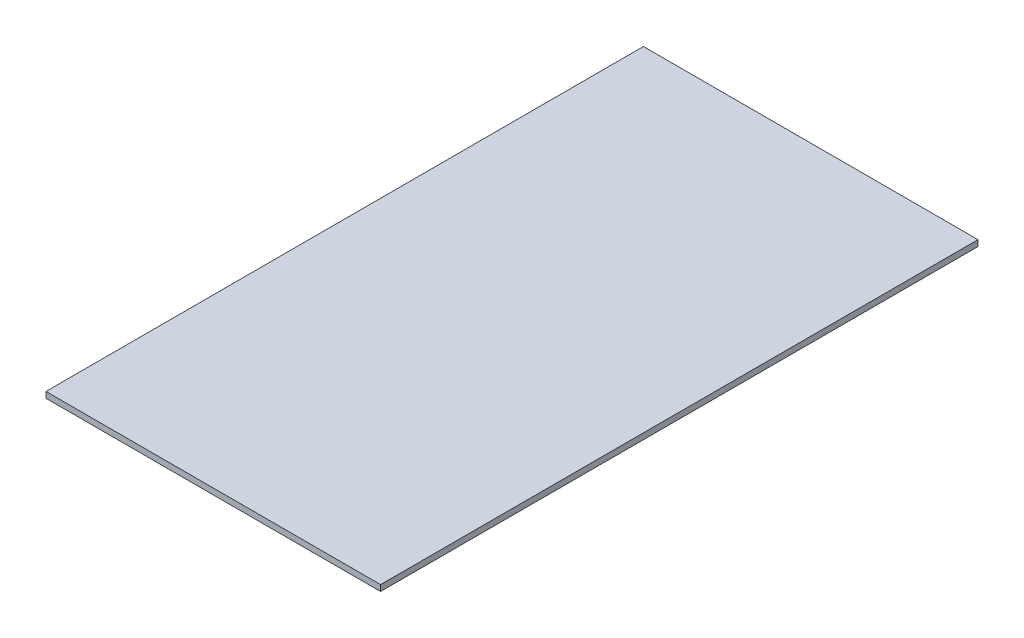
ISO-10303-21;
HEADER;
FILE_DESCRIPTION(('STEP AP214'),'2;1');
FILE_NAME('part.step','',(''),(''),'','','');
FILE_SCHEMA(('AUTOMOTIVE_DESIGN { 1 0 10303 214 1 1 1 1 }'));
ENDSEC;
DATA;
#1=APPLICATION_CONTEXT('core data for automotive mechanical design processes');
#2=APPLICATION_PROTOCOL_DEFINITION('international standard','automotive_design',2000,#1);
#3=PRODUCT_CONTEXT('',#1,'mechanical');
#4=PRODUCT('Part','Part','',(#3));
#5=PRODUCT_RELATED_PRODUCT_CATEGORY('part','',(#4));
#6=PRODUCT_DEFINITION_FORMATION('','',#4);
#7=PRODUCT_DEFINITION_CONTEXT('part definition',#1,'design');
#8=PRODUCT_DEFINITION('design','',#6,#7);
#9=PRODUCT_DEFINITION_SHAPE('','',#8);
#10=(LENGTH_UNIT() NAMED_UNIT(*) SI_UNIT(.MILLI.,.METRE.));
#11=(NAMED_UNIT(*) PLANE_ANGLE_UNIT() SI_UNIT($,.RADIAN.));
#12=(NAMED_UNIT(*) SI_UNIT($,.STERADIAN.) SOLID_ANGLE_UNIT());
#13=UNCERTAINTY_MEASURE_WITH_UNIT(LENGTH_MEASURE(1.E-05),#10,'distance_accuracy_value','');
#14=(GEOMETRIC_REPRESENTATION_CONTEXT(3) GLOBAL_UNCERTAINTY_ASSIGNED_CONTEXT((#13)) GLOBAL_UNIT_ASSIGNED_CONTEXT((#10,
#11,#12)) REPRESENTATION_CONTEXT('',''));
#15=CARTESIAN_POINT('',(0.,0.,0.));
#16=DIRECTION('',(0.,0.,1.));
#17=DIRECTION('',(1.,0.,0.));
#18=AXIS2_PLACEMENT_3D('',#15,#16,#17);
#19=CARTESIAN_POINT('',(0.,6.35,0.));
#20=DIRECTION('',(1.,0.,0.));
#21=DIRECTION('',(0.,0.,-1.));
#22=AXIS2_PLACEMENT_3D('',#19,#20,#21);
#23=PLANE('',#22);
#24=DIRECTION('',(0.,0.,1.));
#25=VECTOR('',#24,1.);
#26=CARTESIAN_POINT('',(0.,0.,0.));
#27=LINE('',#26,#25);
#28=CARTESIAN_POINT('',(0.,0.,-635.));
#29=VERTEX_POINT('',#28);
#30=CARTESIAN_POINT('',(0.,0.,0.));
#31=VERTEX_POINT('',#30);
#32=EDGE_CURVE('E96',#29,#31,#27,.T.);
#33=ORIENTED_EDGE('',*,*,#32,.T.);
#34=DIRECTION('',(0.,-1.,0.));
#35=VECTOR('',#34,1.);
#36=CARTESIAN_POINT('',(0.,6.35,0.));
#37=LINE('',#36,#35);
#38=CARTESIAN_POINT('',(0.,6.35,0.));
#39=VERTEX_POINT('',#38);
#40=EDGE_CURVE('E11',#39,#31,#37,.T.);
#41=ORIENTED_EDGE('',*,*,#40,.F.);
#42=DIRECTION('',(0.,0.,1.));
#43=VECTOR('',#42,1.);
#44=CARTESIAN_POINT('',(0.,6.35,0.));
#45=LINE('',#44,#43);
#46=CARTESIAN_POINT('',(0.,6.35,-635.));
#47=VERTEX_POINT('',#46);
#48=EDGE_CURVE('E84',#47,#39,#45,.T.);
#49=ORIENTED_EDGE('',*,*,#48,.F.);
#50=DIRECTION('',(0.,-1.,0.));
#51=VECTOR('',#50,1.);
#52=CARTESIAN_POINT('',(0.,6.35,-635.));
#53=LINE('',#52,#51);
#54=EDGE_CURVE('E92',#47,#29,#53,.T.);
#55=ORIENTED_EDGE('',*,*,#54,.T.);
#56=EDGE_LOOP('',(#33,#41,#49,#55));
#57=FACE_BOUND('',#56,.T.);
#58=ADVANCED_FACE('F33',(#57),#23,.F.);
#59=CARTESIAN_POINT('',(0.,6.35,0.));
#60=DIRECTION('',(0.,0.,-1.));
#61=DIRECTION('',(-1.,0.,0.));
#62=AXIS2_PLACEMENT_3D('',#59,#60,#61);
#63=PLANE('',#62);
#64=DIRECTION('',(1.,0.,0.));
#65=VECTOR('',#64,1.);
#66=CARTESIAN_POINT('',(0.,0.,0.));
#67=LINE('',#66,#65);
#68=CARTESIAN_POINT('',(355.6,0.,0.));
#69=VERTEX_POINT('',#68);
#70=EDGE_CURVE('E88',#31,#69,#67,.T.);
#71=ORIENTED_EDGE('',*,*,#70,.T.);
#72=DIRECTION('',(0.,-1.,0.));
#73=VECTOR('',#72,1.);
#74=CARTESIAN_POINT('',(355.6,6.35,0.));
#75=LINE('',#74,#73);
#76=CARTESIAN_POINT('',(355.6,6.35,0.));
#77=VERTEX_POINT('',#76);
#78=EDGE_CURVE('E41',#77,#69,#75,.T.);
#79=ORIENTED_EDGE('',*,*,#78,.F.);
#80=DIRECTION('',(1.,0.,0.));
#81=VECTOR('',#80,1.);
#82=CARTESIAN_POINT('',(0.,6.35,0.));
#83=LINE('',#82,#81);
#84=EDGE_CURVE('E79',#39,#77,#83,.T.);
#85=ORIENTED_EDGE('',*,*,#84,.F.);
#86=ORIENTED_EDGE('',*,*,#40,.T.);
#87=EDGE_LOOP('',(#71,#79,#85,#86));
#88=FACE_BOUND('',#87,.T.);
#89=ADVANCED_FACE('F87',(#88),#63,.F.);
#90=CARTESIAN_POINT('',(355.6,6.35,0.));
#91=DIRECTION('',(-1.,0.,0.));
#92=DIRECTION('',(0.,0.,1.));
#93=AXIS2_PLACEMENT_3D('',#90,#91,#92);
#94=PLANE('',#93);
#95=DIRECTION('',(0.,0.,-1.));
#96=VECTOR('',#95,1.);
#97=CARTESIAN_POINT('',(355.6,0.,0.));
#98=LINE('',#97,#96);
#99=CARTESIAN_POINT('',(355.6,0.,-635.));
#100=VERTEX_POINT('',#99);
#101=EDGE_CURVE('E66',#69,#100,#98,.T.);
#102=ORIENTED_EDGE('',*,*,#101,.T.);
#103=DIRECTION('',(0.,-1.,0.));
#104=VECTOR('',#103,1.);
#105=CARTESIAN_POINT('',(355.6,6.35,-635.));
#106=LINE('',#105,#104);
#107=CARTESIAN_POINT('',(355.6,6.35,-635.));
#108=VERTEX_POINT('',#107);
#109=EDGE_CURVE('E89',#108,#100,#106,.T.);
#110=ORIENTED_EDGE('',*,*,#109,.F.);
#111=DIRECTION('',(0.,0.,-1.));
#112=VECTOR('',#111,1.);
#113=CARTESIAN_POINT('',(355.6,6.35,0.));
#114=LINE('',#113,#112);
#115=EDGE_CURVE('E82',#77,#108,#114,.T.);
#116=ORIENTED_EDGE('',*,*,#115,.F.);
#117=ORIENTED_EDGE('',*,*,#78,.T.);
#118=EDGE_LOOP('',(#102,#110,#116,#117));
#119=FACE_BOUND('',#118,.T.);
#120=ADVANCED_FACE('F90',(#119),#94,.F.);
#121=CARTESIAN_POINT('',(0.,6.35,-635.));
#122=DIRECTION('',(0.,0.,1.));
#123=DIRECTION('',(1.,0.,0.));
#124=AXIS2_PLACEMENT_3D('',#121,#122,#123);
#125=PLANE('',#124);
#126=DIRECTION('',(-1.,0.,0.));
#127=VECTOR('',#126,1.);
#128=CARTESIAN_POINT('',(0.,0.,-635.));
#129=LINE('',#128,#127);
#130=EDGE_CURVE('E72',#100,#29,#129,.T.);
#131=ORIENTED_EDGE('',*,*,#130,.T.);
#132=ORIENTED_EDGE('',*,*,#54,.F.);
#133=DIRECTION('',(-1.,0.,0.));
#134=VECTOR('',#133,1.);
#135=CARTESIAN_POINT('',(0.,6.35,-635.));
#136=LINE('',#135,#134);
#137=EDGE_CURVE('E49',#108,#47,#136,.T.);
#138=ORIENTED_EDGE('',*,*,#137,.F.);
#139=ORIENTED_EDGE('',*,*,#109,.T.);
#140=EDGE_LOOP('',(#131,#132,#138,#139));
#141=FACE_BOUND('',#140,.T.);
#142=ADVANCED_FACE('F103',(#141),#125,.F.);
#143=CARTESIAN_POINT('',(0.,6.35,0.));
#144=DIRECTION('',(0.,-1.,0.));
#145=DIRECTION('',(0.,0.,-1.));
#146=AXIS2_PLACEMENT_3D('',#143,#144,#145);
#147=PLANE('',#146);
#148=ORIENTED_EDGE('',*,*,#48,.T.);
#149=ORIENTED_EDGE('',*,*,#84,.T.);
#150=ORIENTED_EDGE('',*,*,#115,.T.);
#151=ORIENTED_EDGE('',*,*,#137,.T.);
#152=EDGE_LOOP('',(#148,#149,#150,#151));
#153=FACE_BOUND('',#152,.T.);
#154=ADVANCED_FACE('F80',(#153),#147,.F.);
#155=CARTESIAN_POINT('',(0.,0.,0.));
#156=DIRECTION('',(0.,-1.,0.));
#157=DIRECTION('',(0.,0.,-1.));
#158=AXIS2_PLACEMENT_3D('',#155,#156,#157);
#159=PLANE('',#158);
#160=ORIENTED_EDGE('',*,*,#32,.F.);
#161=ORIENTED_EDGE('',*,*,#130,.F.);
#162=ORIENTED_EDGE('',*,*,#101,.F.);
#163=ORIENTED_EDGE('',*,*,#70,.F.);
#164=EDGE_LOOP('',(#160,#161,#162,#163));
#165=FACE_BOUND('',#164,.T.);
#166=ADVANCED_FACE('F106',(#165),#159,.T.);
#167=CLOSED_SHELL('',(#58,#89,#120,#142,#154,#166));
#168=MANIFOLD_SOLID_BREP('B2',#167);
#169=ADVANCED_BREP_SHAPE_REPRESENTATION('',(#18,#168),#14);
#170=SHAPE_DEFINITION_REPRESENTATION(#9,#169);
ENDSEC;
END-ISO-10303-21;
